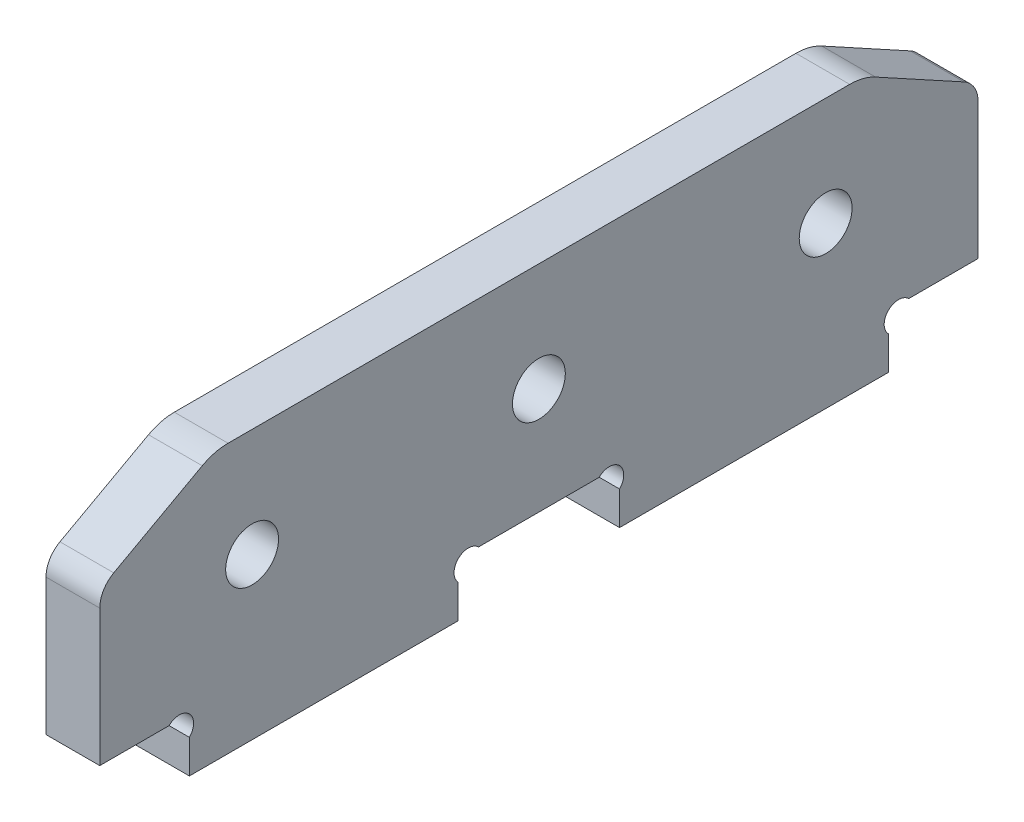
ISO-10303-21;
HEADER;
FILE_DESCRIPTION(('STEP AP214'),'2;1');
FILE_NAME('part.step','',(''),(''),'','','');
FILE_SCHEMA(('AUTOMOTIVE_DESIGN { 1 0 10303 214 1 1 1 1 }'));
ENDSEC;
DATA;
#1=APPLICATION_CONTEXT('core data for automotive mechanical design processes');
#2=APPLICATION_PROTOCOL_DEFINITION('international standard','automotive_design',2000,#1);
#3=PRODUCT_CONTEXT('',#1,'mechanical');
#4=PRODUCT('Part','Part','',(#3));
#5=PRODUCT_RELATED_PRODUCT_CATEGORY('part','',(#4));
#6=PRODUCT_DEFINITION_FORMATION('','',#4);
#7=PRODUCT_DEFINITION_CONTEXT('part definition',#1,'design');
#8=PRODUCT_DEFINITION('design','',#6,#7);
#9=PRODUCT_DEFINITION_SHAPE('','',#8);
#10=(LENGTH_UNIT() NAMED_UNIT(*) SI_UNIT(.MILLI.,.METRE.));
#11=(NAMED_UNIT(*) PLANE_ANGLE_UNIT() SI_UNIT($,.RADIAN.));
#12=(NAMED_UNIT(*) SI_UNIT($,.STERADIAN.) SOLID_ANGLE_UNIT());
#13=UNCERTAINTY_MEASURE_WITH_UNIT(LENGTH_MEASURE(1.E-05),#10,'distance_accuracy_value','');
#14=(GEOMETRIC_REPRESENTATION_CONTEXT(3) GLOBAL_UNCERTAINTY_ASSIGNED_CONTEXT((#13)) GLOBAL_UNIT_ASSIGNED_CONTEXT((#10,
#11,#12)) REPRESENTATION_CONTEXT('',''));
#15=CARTESIAN_POINT('',(0.,0.,0.));
#16=DIRECTION('',(0.,0.,1.));
#17=DIRECTION('',(1.,0.,0.));
#18=AXIS2_PLACEMENT_3D('',#15,#16,#17);
#19=CARTESIAN_POINT('',(6.,21.2224800303392,-3.));
#20=DIRECTION('',(-1.,0.,0.));
#21=DIRECTION('',(0.,0.,1.));
#22=AXIS2_PLACEMENT_3D('',#19,#20,#21);
#23=PLANE('',#22);
#24=CARTESIAN_POINT('',(6.,17.92,-17.));
#25=DIRECTION('',(1.,0.,0.));
#26=DIRECTION('',(0.,0.,-1.));
#27=AXIS2_PLACEMENT_3D('',#24,#25,#26);
#28=CIRCLE('',#27,2.95);
#29=CARTESIAN_POINT('',(6.,17.92,-19.95));
#30=VERTEX_POINT('',#29);
#31=EDGE_CURVE('E475',#30,#30,#28,.T.);
#32=ORIENTED_EDGE('',*,*,#31,.F.);
#33=EDGE_LOOP('',(#32));
#34=FACE_BOUND('',#33,.T.);
#35=CARTESIAN_POINT('',(6.,21.2224800303392,-3.));
#36=DIRECTION('',(1.,0.,0.));
#37=DIRECTION('',(0.,0.,1.));
#38=AXIS2_PLACEMENT_3D('',#35,#36,#37);
#39=CIRCLE('',#38,3.);
#40=CARTESIAN_POINT('',(6.,23.8537688338637,-1.55905613140326));
#41=VERTEX_POINT('',#40);
#42=CARTESIAN_POINT('',(6.,21.2224800303392,0.));
#43=VERTEX_POINT('',#42);
#44=EDGE_CURVE('E240',#41,#43,#39,.T.);
#45=ORIENTED_EDGE('',*,*,#44,.T.);
#46=DIRECTION('',(0.,-1.,0.));
#47=VECTOR('',#46,1.);
#48=CARTESIAN_POINT('',(6.,21.2224800303392,0.));
#49=LINE('',#48,#47);
#50=CARTESIAN_POINT('',(6.,6.,0.));
#51=VERTEX_POINT('',#50);
#52=EDGE_CURVE('E189',#43,#51,#49,.T.);
#53=ORIENTED_EDGE('',*,*,#52,.T.);
#54=DIRECTION('',(0.,0.,-1.));
#55=VECTOR('',#54,1.);
#56=CARTESIAN_POINT('',(6.,6.,0.));
#57=LINE('',#56,#55);
#58=CARTESIAN_POINT('',(6.,6.,-7.73725830020306));
#59=VERTEX_POINT('',#58);
#60=EDGE_CURVE('E243',#51,#59,#57,.T.);
#61=ORIENTED_EDGE('',*,*,#60,.T.);
#62=CARTESIAN_POINT('',(6.,4.86862915010151,-8.86862915010152));
#63=DIRECTION('',(-1.,0.,0.));
#64=DIRECTION('',(0.,0.,1.));
#65=AXIS2_PLACEMENT_3D('',#62,#63,#64);
#66=CIRCLE('',#65,1.6);
#67=CARTESIAN_POINT('',(6.,3.73725830020304,-10.));
#68=VERTEX_POINT('',#67);
#69=EDGE_CURVE('E245',#59,#68,#66,.T.);
#70=ORIENTED_EDGE('',*,*,#69,.T.);
#71=DIRECTION('',(0.,-1.,0.));
#72=VECTOR('',#71,1.);
#73=CARTESIAN_POINT('',(6.,3.73725830020304,-10.));
#74=LINE('',#73,#72);
#75=CARTESIAN_POINT('',(6.,0.,-10.));
#76=VERTEX_POINT('',#75);
#77=EDGE_CURVE('E247',#68,#76,#74,.T.);
#78=ORIENTED_EDGE('',*,*,#77,.T.);
#79=DIRECTION('',(0.,0.,-1.));
#80=VECTOR('',#79,1.);
#81=CARTESIAN_POINT('',(6.,0.,-10.));
#82=LINE('',#81,#80);
#83=CARTESIAN_POINT('',(6.,0.,-40.));
#84=VERTEX_POINT('',#83);
#85=EDGE_CURVE('E249',#76,#84,#82,.T.);
#86=ORIENTED_EDGE('',*,*,#85,.T.);
#87=DIRECTION('',(0.,1.,0.));
#88=VECTOR('',#87,1.);
#89=CARTESIAN_POINT('',(6.,0.,-40.));
#90=LINE('',#89,#88);
#91=CARTESIAN_POINT('',(6.,3.73725830020304,-40.));
#92=VERTEX_POINT('',#91);
#93=EDGE_CURVE('E251',#84,#92,#90,.T.);
#94=ORIENTED_EDGE('',*,*,#93,.T.);
#95=CARTESIAN_POINT('',(6.,4.86862915010152,-41.1313708498985));
#96=DIRECTION('',(-1.,0.,0.));
#97=DIRECTION('',(0.,0.,-1.));
#98=AXIS2_PLACEMENT_3D('',#95,#96,#97);
#99=CIRCLE('',#98,1.6);
#100=CARTESIAN_POINT('',(6.,6.,-42.2627416997969));
#101=VERTEX_POINT('',#100);
#102=EDGE_CURVE('E253',#92,#101,#99,.T.);
#103=ORIENTED_EDGE('',*,*,#102,.T.);
#104=DIRECTION('',(0.,0.,-1.));
#105=VECTOR('',#104,1.);
#106=CARTESIAN_POINT('',(6.,6.,-42.2627416997969));
#107=LINE('',#106,#105);
#108=CARTESIAN_POINT('',(6.,6.,-55.737258300203));
#109=VERTEX_POINT('',#108);
#110=EDGE_CURVE('E255',#101,#109,#107,.T.);
#111=ORIENTED_EDGE('',*,*,#110,.T.);
#112=CARTESIAN_POINT('',(6.,4.86862915010152,-56.8686291501015));
#113=DIRECTION('',(-1.,0.,0.));
#114=DIRECTION('',(0.,0.,1.));
#115=AXIS2_PLACEMENT_3D('',#112,#113,#114);
#116=CIRCLE('',#115,1.6);
#117=CARTESIAN_POINT('',(6.,3.73725830020305,-58.));
#118=VERTEX_POINT('',#117);
#119=EDGE_CURVE('E257',#109,#118,#116,.T.);
#120=ORIENTED_EDGE('',*,*,#119,.T.);
#121=DIRECTION('',(0.,-1.,0.));
#122=VECTOR('',#121,1.);
#123=CARTESIAN_POINT('',(6.,0.,-58.));
#124=LINE('',#123,#122);
#125=CARTESIAN_POINT('',(6.,0.,-58.));
#126=VERTEX_POINT('',#125);
#127=EDGE_CURVE('E259',#118,#126,#124,.T.);
#128=ORIENTED_EDGE('',*,*,#127,.T.);
#129=DIRECTION('',(0.,0.,-1.));
#130=VECTOR('',#129,1.);
#131=CARTESIAN_POINT('',(6.,0.,-88.));
#132=LINE('',#131,#130);
#133=CARTESIAN_POINT('',(6.,0.,-88.));
#134=VERTEX_POINT('',#133);
#135=EDGE_CURVE('E261',#126,#134,#132,.T.);
#136=ORIENTED_EDGE('',*,*,#135,.T.);
#137=DIRECTION('',(0.,1.,0.));
#138=VECTOR('',#137,1.);
#139=CARTESIAN_POINT('',(6.,3.73725830020307,-88.));
#140=LINE('',#139,#138);
#141=CARTESIAN_POINT('',(6.,3.73725830020307,-88.));
#142=VERTEX_POINT('',#141);
#143=EDGE_CURVE('E263',#134,#142,#140,.T.);
#144=ORIENTED_EDGE('',*,*,#143,.T.);
#145=CARTESIAN_POINT('',(6.,4.86862915010154,-89.1313708498984));
#146=DIRECTION('',(-1.,0.,0.));
#147=DIRECTION('',(0.,0.,-1.));
#148=AXIS2_PLACEMENT_3D('',#145,#146,#147);
#149=CIRCLE('',#148,1.6);
#150=CARTESIAN_POINT('',(6.,6.00000000000003,-90.2627416997969));
#151=VERTEX_POINT('',#150);
#152=EDGE_CURVE('E265',#142,#151,#149,.T.);
#153=ORIENTED_EDGE('',*,*,#152,.T.);
#154=DIRECTION('',(0.,0.,-1.));
#155=VECTOR('',#154,1.);
#156=CARTESIAN_POINT('',(6.,6.00000000000003,-98.));
#157=LINE('',#156,#155);
#158=CARTESIAN_POINT('',(6.,6.00000000000003,-98.));
#159=VERTEX_POINT('',#158);
#160=EDGE_CURVE('E267',#151,#159,#157,.T.);
#161=ORIENTED_EDGE('',*,*,#160,.T.);
#162=DIRECTION('',(0.,1.,0.));
#163=VECTOR('',#162,1.);
#164=CARTESIAN_POINT('',(6.,21.2224800303392,-98.));
#165=LINE('',#164,#163);
#166=CARTESIAN_POINT('',(6.,21.2224800303392,-98.));
#167=VERTEX_POINT('',#166);
#168=EDGE_CURVE('E269',#159,#167,#165,.T.);
#169=ORIENTED_EDGE('',*,*,#168,.T.);
#170=CARTESIAN_POINT('',(6.,21.2224800303392,-95.));
#171=DIRECTION('',(1.,0.,0.));
#172=DIRECTION('',(0.,0.,1.));
#173=AXIS2_PLACEMENT_3D('',#170,#171,#172);
#174=CIRCLE('',#173,3.);
#175=CARTESIAN_POINT('',(6.,23.8537688338637,-96.4409438685967));
#176=VERTEX_POINT('',#175);
#177=EDGE_CURVE('E271',#167,#176,#174,.T.);
#178=ORIENTED_EDGE('',*,*,#177,.T.);
#179=DIRECTION('',(0.,0.480314622865584,0.877096267841502));
#180=VECTOR('',#179,1.);
#181=CARTESIAN_POINT('',(6.,23.8537688338637,-96.4409438685967));
#182=LINE('',#181,#180);
#183=CARTESIAN_POINT('',(6.,29.262577607049,-86.5639887175627));
#184=VERTEX_POINT('',#183);
#185=EDGE_CURVE('E273',#176,#184,#182,.T.);
#186=ORIENTED_EDGE('',*,*,#185,.T.);
#187=CARTESIAN_POINT('',(6.,24.,-83.6821009803692));
#188=DIRECTION('',(1.,0.,0.));
#189=DIRECTION('',(0.,0.,1.));
#190=AXIS2_PLACEMENT_3D('',#187,#188,#189);
#191=CIRCLE('',#190,6.);
#192=CARTESIAN_POINT('',(6.,30.,-83.6821009803692));
#193=VERTEX_POINT('',#192);
#194=EDGE_CURVE('E275',#184,#193,#191,.T.);
#195=ORIENTED_EDGE('',*,*,#194,.T.);
#196=DIRECTION('',(0.,0.,1.));
#197=VECTOR('',#196,1.);
#198=CARTESIAN_POINT('',(6.,30.,-14.3178990196308));
#199=LINE('',#198,#197);
#200=CARTESIAN_POINT('',(6.,30.,-14.3178990196308));
#201=VERTEX_POINT('',#200);
#202=EDGE_CURVE('E277',#193,#201,#199,.T.);
#203=ORIENTED_EDGE('',*,*,#202,.T.);
#204=CARTESIAN_POINT('',(6.,24.,-14.3178990196308));
#205=DIRECTION('',(1.,0.,0.));
#206=DIRECTION('',(0.,0.,1.));
#207=AXIS2_PLACEMENT_3D('',#204,#205,#206);
#208=CIRCLE('',#207,6.);
#209=CARTESIAN_POINT('',(6.,29.262577607049,-11.4360112824373));
#210=VERTEX_POINT('',#209);
#211=EDGE_CURVE('E46',#201,#210,#208,.T.);
#212=ORIENTED_EDGE('',*,*,#211,.T.);
#213=DIRECTION('',(0.,-0.480314622865584,0.877096267841502));
#214=VECTOR('',#213,1.);
#215=CARTESIAN_POINT('',(6.,23.8537688338637,-1.55905613140326));
#216=LINE('',#215,#214);
#217=EDGE_CURVE('E41',#210,#41,#216,.T.);
#218=ORIENTED_EDGE('',*,*,#217,.T.);
#219=EDGE_LOOP('',(#45,#53,#61,#70,#78,#86,#94,#103,#111,#120,#128,#136,#144,#153,#161,#169,
#178,#186,#195,#203,#212,#218));
#220=FACE_BOUND('',#219,.T.);
#221=CARTESIAN_POINT('',(6.,17.92,-49.));
#222=DIRECTION('',(1.,0.,0.));
#223=DIRECTION('',(0.,0.,-1.));
#224=AXIS2_PLACEMENT_3D('',#221,#222,#223);
#225=CIRCLE('',#224,2.95);
#226=CARTESIAN_POINT('',(6.,17.92,-51.95));
#227=VERTEX_POINT('',#226);
#228=EDGE_CURVE('E194',#227,#227,#225,.T.);
#229=ORIENTED_EDGE('',*,*,#228,.F.);
#230=EDGE_LOOP('',(#229));
#231=FACE_BOUND('',#230,.T.);
#232=CARTESIAN_POINT('',(6.,17.92,-81.));
#233=DIRECTION('',(1.,0.,0.));
#234=DIRECTION('',(0.,0.,1.));
#235=AXIS2_PLACEMENT_3D('',#232,#233,#234);
#236=CIRCLE('',#235,2.95);
#237=CARTESIAN_POINT('',(6.,17.92,-78.05));
#238=VERTEX_POINT('',#237);
#239=EDGE_CURVE('E464',#238,#238,#236,.T.);
#240=ORIENTED_EDGE('',*,*,#239,.F.);
#241=EDGE_LOOP('',(#240));
#242=FACE_BOUND('',#241,.T.);
#243=ADVANCED_FACE('F26',(#34,#220,#231,#242),#23,.F.);
#244=CARTESIAN_POINT('',(0.,21.2224800303392,-3.));
#245=DIRECTION('',(-1.,0.,0.));
#246=DIRECTION('',(0.,0.,1.));
#247=AXIS2_PLACEMENT_3D('',#244,#245,#246);
#248=PLANE('',#247);
#249=CARTESIAN_POINT('',(0.,17.92,-17.));
#250=DIRECTION('',(1.,0.,0.));
#251=DIRECTION('',(0.,0.,-1.));
#252=AXIS2_PLACEMENT_3D('',#249,#250,#251);
#253=CIRCLE('',#252,2.95);
#254=CARTESIAN_POINT('',(0.,17.92,-19.95));
#255=VERTEX_POINT('',#254);
#256=EDGE_CURVE('E470',#255,#255,#253,.T.);
#257=ORIENTED_EDGE('',*,*,#256,.T.);
#258=EDGE_LOOP('',(#257));
#259=FACE_BOUND('',#258,.T.);
#260=CARTESIAN_POINT('',(0.,21.2224800303392,-3.));
#261=DIRECTION('',(1.,0.,0.));
#262=DIRECTION('',(0.,0.,1.));
#263=AXIS2_PLACEMENT_3D('',#260,#261,#262);
#264=CIRCLE('',#263,3.);
#265=CARTESIAN_POINT('',(0.,23.8537688338637,-1.55905613140326));
#266=VERTEX_POINT('',#265);
#267=CARTESIAN_POINT('',(0.,21.2224800303392,0.));
#268=VERTEX_POINT('',#267);
#269=EDGE_CURVE('E180',#266,#268,#264,.T.);
#270=ORIENTED_EDGE('',*,*,#269,.F.);
#271=DIRECTION('',(0.,-0.480314622865584,0.877096267841502));
#272=VECTOR('',#271,1.);
#273=CARTESIAN_POINT('',(0.,23.8537688338637,-1.55905613140326));
#274=LINE('',#273,#272);
#275=CARTESIAN_POINT('',(0.,29.262577607049,-11.4360112824373));
#276=VERTEX_POINT('',#275);
#277=EDGE_CURVE('E238',#276,#266,#274,.T.);
#278=ORIENTED_EDGE('',*,*,#277,.F.);
#279=CARTESIAN_POINT('',(0.,24.,-14.3178990196308));
#280=DIRECTION('',(1.,0.,0.));
#281=DIRECTION('',(0.,0.,1.));
#282=AXIS2_PLACEMENT_3D('',#279,#280,#281);
#283=CIRCLE('',#282,6.);
#284=CARTESIAN_POINT('',(0.,30.,-14.3178990196308));
#285=VERTEX_POINT('',#284);
#286=EDGE_CURVE('E236',#285,#276,#283,.T.);
#287=ORIENTED_EDGE('',*,*,#286,.F.);
#288=DIRECTION('',(0.,0.,1.));
#289=VECTOR('',#288,1.);
#290=CARTESIAN_POINT('',(0.,30.,-14.3178990196308));
#291=LINE('',#290,#289);
#292=CARTESIAN_POINT('',(0.,30.,-83.6821009803692));
#293=VERTEX_POINT('',#292);
#294=EDGE_CURVE('E234',#293,#285,#291,.T.);
#295=ORIENTED_EDGE('',*,*,#294,.F.);
#296=CARTESIAN_POINT('',(0.,24.,-83.6821009803692));
#297=DIRECTION('',(1.,0.,0.));
#298=DIRECTION('',(0.,0.,1.));
#299=AXIS2_PLACEMENT_3D('',#296,#297,#298);
#300=CIRCLE('',#299,6.);
#301=CARTESIAN_POINT('',(0.,29.262577607049,-86.5639887175627));
#302=VERTEX_POINT('',#301);
#303=EDGE_CURVE('E232',#302,#293,#300,.T.);
#304=ORIENTED_EDGE('',*,*,#303,.F.);
#305=DIRECTION('',(0.,0.480314622865584,0.877096267841502));
#306=VECTOR('',#305,1.);
#307=CARTESIAN_POINT('',(0.,23.8537688338637,-96.4409438685967));
#308=LINE('',#307,#306);
#309=CARTESIAN_POINT('',(0.,23.8537688338637,-96.4409438685967));
#310=VERTEX_POINT('',#309);
#311=EDGE_CURVE('E230',#310,#302,#308,.T.);
#312=ORIENTED_EDGE('',*,*,#311,.F.);
#313=CARTESIAN_POINT('',(0.,21.2224800303392,-95.));
#314=DIRECTION('',(1.,0.,0.));
#315=DIRECTION('',(0.,0.,1.));
#316=AXIS2_PLACEMENT_3D('',#313,#314,#315);
#317=CIRCLE('',#316,3.);
#318=CARTESIAN_POINT('',(0.,21.2224800303392,-98.));
#319=VERTEX_POINT('',#318);
#320=EDGE_CURVE('E228',#319,#310,#317,.T.);
#321=ORIENTED_EDGE('',*,*,#320,.F.);
#322=DIRECTION('',(0.,1.,0.));
#323=VECTOR('',#322,1.);
#324=CARTESIAN_POINT('',(0.,21.2224800303392,-98.));
#325=LINE('',#324,#323);
#326=CARTESIAN_POINT('',(0.,6.00000000000003,-98.));
#327=VERTEX_POINT('',#326);
#328=EDGE_CURVE('E226',#327,#319,#325,.T.);
#329=ORIENTED_EDGE('',*,*,#328,.F.);
#330=DIRECTION('',(0.,0.,-1.));
#331=VECTOR('',#330,1.);
#332=CARTESIAN_POINT('',(0.,6.00000000000003,-98.));
#333=LINE('',#332,#331);
#334=CARTESIAN_POINT('',(0.,6.00000000000003,-90.2627416997969));
#335=VERTEX_POINT('',#334);
#336=EDGE_CURVE('E224',#335,#327,#333,.T.);
#337=ORIENTED_EDGE('',*,*,#336,.F.);
#338=CARTESIAN_POINT('',(0.,4.86862915010154,-89.1313708498984));
#339=DIRECTION('',(-1.,0.,0.));
#340=DIRECTION('',(0.,0.,-1.));
#341=AXIS2_PLACEMENT_3D('',#338,#339,#340);
#342=CIRCLE('',#341,1.6);
#343=CARTESIAN_POINT('',(0.,3.73725830020307,-88.));
#344=VERTEX_POINT('',#343);
#345=EDGE_CURVE('E222',#344,#335,#342,.T.);
#346=ORIENTED_EDGE('',*,*,#345,.F.);
#347=DIRECTION('',(0.,1.,0.));
#348=VECTOR('',#347,1.);
#349=CARTESIAN_POINT('',(0.,3.73725830020307,-88.));
#350=LINE('',#349,#348);
#351=CARTESIAN_POINT('',(0.,0.,-88.));
#352=VERTEX_POINT('',#351);
#353=EDGE_CURVE('E220',#352,#344,#350,.T.);
#354=ORIENTED_EDGE('',*,*,#353,.F.);
#355=DIRECTION('',(0.,0.,-1.));
#356=VECTOR('',#355,1.);
#357=CARTESIAN_POINT('',(0.,0.,-88.));
#358=LINE('',#357,#356);
#359=CARTESIAN_POINT('',(0.,0.,-58.));
#360=VERTEX_POINT('',#359);
#361=EDGE_CURVE('E218',#360,#352,#358,.T.);
#362=ORIENTED_EDGE('',*,*,#361,.F.);
#363=DIRECTION('',(0.,-1.,0.));
#364=VECTOR('',#363,1.);
#365=CARTESIAN_POINT('',(0.,0.,-58.));
#366=LINE('',#365,#364);
#367=CARTESIAN_POINT('',(0.,3.73725830020305,-58.));
#368=VERTEX_POINT('',#367);
#369=EDGE_CURVE('E216',#368,#360,#366,.T.);
#370=ORIENTED_EDGE('',*,*,#369,.F.);
#371=CARTESIAN_POINT('',(0.,4.86862915010152,-56.8686291501015));
#372=DIRECTION('',(-1.,0.,0.));
#373=DIRECTION('',(0.,0.,1.));
#374=AXIS2_PLACEMENT_3D('',#371,#372,#373);
#375=CIRCLE('',#374,1.6);
#376=CARTESIAN_POINT('',(0.,6.,-55.737258300203));
#377=VERTEX_POINT('',#376);
#378=EDGE_CURVE('E214',#377,#368,#375,.T.);
#379=ORIENTED_EDGE('',*,*,#378,.F.);
#380=DIRECTION('',(0.,0.,-1.));
#381=VECTOR('',#380,1.);
#382=CARTESIAN_POINT('',(0.,6.,-42.2627416997969));
#383=LINE('',#382,#381);
#384=CARTESIAN_POINT('',(0.,6.,-42.2627416997969));
#385=VERTEX_POINT('',#384);
#386=EDGE_CURVE('E212',#385,#377,#383,.T.);
#387=ORIENTED_EDGE('',*,*,#386,.F.);
#388=CARTESIAN_POINT('',(0.,4.86862915010152,-41.1313708498985));
#389=DIRECTION('',(-1.,0.,0.));
#390=DIRECTION('',(0.,0.,-1.));
#391=AXIS2_PLACEMENT_3D('',#388,#389,#390);
#392=CIRCLE('',#391,1.6);
#393=CARTESIAN_POINT('',(0.,3.73725830020304,-40.));
#394=VERTEX_POINT('',#393);
#395=EDGE_CURVE('E210',#394,#385,#392,.T.);
#396=ORIENTED_EDGE('',*,*,#395,.F.);
#397=DIRECTION('',(0.,1.,0.));
#398=VECTOR('',#397,1.);
#399=CARTESIAN_POINT('',(0.,0.,-40.));
#400=LINE('',#399,#398);
#401=CARTESIAN_POINT('',(0.,0.,-40.));
#402=VERTEX_POINT('',#401);
#403=EDGE_CURVE('E208',#402,#394,#400,.T.);
#404=ORIENTED_EDGE('',*,*,#403,.F.);
#405=DIRECTION('',(0.,0.,-1.));
#406=VECTOR('',#405,1.);
#407=CARTESIAN_POINT('',(0.,0.,-10.));
#408=LINE('',#407,#406);
#409=CARTESIAN_POINT('',(0.,0.,-10.));
#410=VERTEX_POINT('',#409);
#411=EDGE_CURVE('E206',#410,#402,#408,.T.);
#412=ORIENTED_EDGE('',*,*,#411,.F.);
#413=DIRECTION('',(0.,-1.,0.));
#414=VECTOR('',#413,1.);
#415=CARTESIAN_POINT('',(0.,3.73725830020304,-10.));
#416=LINE('',#415,#414);
#417=CARTESIAN_POINT('',(0.,3.73725830020304,-10.));
#418=VERTEX_POINT('',#417);
#419=EDGE_CURVE('E204',#418,#410,#416,.T.);
#420=ORIENTED_EDGE('',*,*,#419,.F.);
#421=CARTESIAN_POINT('',(0.,4.86862915010151,-8.86862915010152));
#422=DIRECTION('',(-1.,0.,0.));
#423=DIRECTION('',(0.,0.,1.));
#424=AXIS2_PLACEMENT_3D('',#421,#422,#423);
#425=CIRCLE('',#424,1.6);
#426=CARTESIAN_POINT('',(0.,6.,-7.73725830020306));
#427=VERTEX_POINT('',#426);
#428=EDGE_CURVE('E202',#427,#418,#425,.T.);
#429=ORIENTED_EDGE('',*,*,#428,.F.);
#430=DIRECTION('',(0.,0.,-1.));
#431=VECTOR('',#430,1.);
#432=CARTESIAN_POINT('',(0.,6.,0.));
#433=LINE('',#432,#431);
#434=CARTESIAN_POINT('',(0.,6.,0.));
#435=VERTEX_POINT('',#434);
#436=EDGE_CURVE('E182',#435,#427,#433,.T.);
#437=ORIENTED_EDGE('',*,*,#436,.F.);
#438=DIRECTION('',(0.,-1.,0.));
#439=VECTOR('',#438,1.);
#440=CARTESIAN_POINT('',(0.,21.2224800303392,0.));
#441=LINE('',#440,#439);
#442=EDGE_CURVE('E175',#268,#435,#441,.T.);
#443=ORIENTED_EDGE('',*,*,#442,.F.);
#444=EDGE_LOOP('',(#270,#278,#287,#295,#304,#312,#321,#329,#337,#346,#354,#362,#370,#379,#387,
#396,#404,#412,#420,#429,#437,#443));
#445=FACE_BOUND('',#444,.T.);
#446=CARTESIAN_POINT('',(0.,17.92,-49.));
#447=DIRECTION('',(1.,0.,0.));
#448=DIRECTION('',(0.,0.,-1.));
#449=AXIS2_PLACEMENT_3D('',#446,#447,#448);
#450=CIRCLE('',#449,2.95);
#451=CARTESIAN_POINT('',(0.,17.92,-51.95));
#452=VERTEX_POINT('',#451);
#453=EDGE_CURVE('E197',#452,#452,#450,.T.);
#454=ORIENTED_EDGE('',*,*,#453,.T.);
#455=EDGE_LOOP('',(#454));
#456=FACE_BOUND('',#455,.T.);
#457=CARTESIAN_POINT('',(0.,17.92,-81.));
#458=DIRECTION('',(1.,0.,0.));
#459=DIRECTION('',(0.,0.,1.));
#460=AXIS2_PLACEMENT_3D('',#457,#458,#459);
#461=CIRCLE('',#460,2.95);
#462=CARTESIAN_POINT('',(0.,17.92,-78.05));
#463=VERTEX_POINT('',#462);
#464=EDGE_CURVE('E467',#463,#463,#461,.T.);
#465=ORIENTED_EDGE('',*,*,#464,.T.);
#466=EDGE_LOOP('',(#465));
#467=FACE_BOUND('',#466,.T.);
#468=ADVANCED_FACE('F176',(#259,#445,#456,#467),#248,.T.);
#469=CARTESIAN_POINT('',(6.,21.2224800303392,-3.));
#470=DIRECTION('',(-1.,0.,0.));
#471=DIRECTION('',(0.,0.,1.));
#472=AXIS2_PLACEMENT_3D('',#469,#470,#471);
#473=CYLINDRICAL_SURFACE('',#472,3.);
#474=ORIENTED_EDGE('',*,*,#269,.T.);
#475=DIRECTION('',(-1.,0.,0.));
#476=VECTOR('',#475,1.);
#477=CARTESIAN_POINT('',(6.,21.2224800303392,0.));
#478=LINE('',#477,#476);
#479=EDGE_CURVE('E11',#43,#268,#478,.T.);
#480=ORIENTED_EDGE('',*,*,#479,.F.);
#481=ORIENTED_EDGE('',*,*,#44,.F.);
#482=DIRECTION('',(-1.,0.,0.));
#483=VECTOR('',#482,1.);
#484=CARTESIAN_POINT('',(6.,23.8537688338637,-1.55905613140326));
#485=LINE('',#484,#483);
#486=EDGE_CURVE('E193',#41,#266,#485,.T.);
#487=ORIENTED_EDGE('',*,*,#486,.T.);
#488=EDGE_LOOP('',(#474,#480,#481,#487));
#489=FACE_BOUND('',#488,.T.);
#490=ADVANCED_FACE('F28',(#489),#473,.T.);
#491=CARTESIAN_POINT('',(6.,21.2224800303392,0.));
#492=DIRECTION('',(0.,0.,-1.));
#493=DIRECTION('',(-1.,0.,0.));
#494=AXIS2_PLACEMENT_3D('',#491,#492,#493);
#495=PLANE('',#494);
#496=ORIENTED_EDGE('',*,*,#442,.T.);
#497=DIRECTION('',(-1.,0.,0.));
#498=VECTOR('',#497,1.);
#499=CARTESIAN_POINT('',(6.,6.,0.));
#500=LINE('',#499,#498);
#501=EDGE_CURVE('E34',#51,#435,#500,.T.);
#502=ORIENTED_EDGE('',*,*,#501,.F.);
#503=ORIENTED_EDGE('',*,*,#52,.F.);
#504=ORIENTED_EDGE('',*,*,#479,.T.);
#505=EDGE_LOOP('',(#496,#502,#503,#504));
#506=FACE_BOUND('',#505,.T.);
#507=ADVANCED_FACE('F188',(#506),#495,.F.);
#508=CARTESIAN_POINT('',(6.,6.,0.));
#509=DIRECTION('',(0.,1.,0.));
#510=DIRECTION('',(0.,0.,1.));
#511=AXIS2_PLACEMENT_3D('',#508,#509,#510);
#512=PLANE('',#511);
#513=ORIENTED_EDGE('',*,*,#436,.T.);
#514=DIRECTION('',(-1.,0.,0.));
#515=VECTOR('',#514,1.);
#516=CARTESIAN_POINT('',(6.,6.,-7.73725830020306));
#517=LINE('',#516,#515);
#518=EDGE_CURVE('E336',#59,#427,#517,.T.);
#519=ORIENTED_EDGE('',*,*,#518,.F.);
#520=ORIENTED_EDGE('',*,*,#60,.F.);
#521=ORIENTED_EDGE('',*,*,#501,.T.);
#522=EDGE_LOOP('',(#513,#519,#520,#521));
#523=FACE_BOUND('',#522,.T.);
#524=ADVANCED_FACE('F340',(#523),#512,.F.);
#525=CARTESIAN_POINT('',(6.,4.86862915010151,-8.86862915010152));
#526=DIRECTION('',(-1.,0.,0.));
#527=DIRECTION('',(0.,0.,1.));
#528=AXIS2_PLACEMENT_3D('',#525,#526,#527);
#529=CYLINDRICAL_SURFACE('',#528,1.6);
#530=ORIENTED_EDGE('',*,*,#428,.T.);
#531=DIRECTION('',(-1.,0.,0.));
#532=VECTOR('',#531,1.);
#533=CARTESIAN_POINT('',(6.,3.73725830020304,-10.));
#534=LINE('',#533,#532);
#535=EDGE_CURVE('E333',#68,#418,#534,.T.);
#536=ORIENTED_EDGE('',*,*,#535,.F.);
#537=ORIENTED_EDGE('',*,*,#69,.F.);
#538=ORIENTED_EDGE('',*,*,#518,.T.);
#539=EDGE_LOOP('',(#530,#536,#537,#538));
#540=FACE_BOUND('',#539,.T.);
#541=ADVANCED_FACE('F348',(#540),#529,.F.);
#542=CARTESIAN_POINT('',(6.,3.73725830020304,-10.));
#543=DIRECTION('',(0.,0.,-1.));
#544=DIRECTION('',(-1.,0.,0.));
#545=AXIS2_PLACEMENT_3D('',#542,#543,#544);
#546=PLANE('',#545);
#547=ORIENTED_EDGE('',*,*,#419,.T.);
#548=DIRECTION('',(-1.,0.,0.));
#549=VECTOR('',#548,1.);
#550=CARTESIAN_POINT('',(6.,0.,-10.));
#551=LINE('',#550,#549);
#552=EDGE_CURVE('E330',#76,#410,#551,.T.);
#553=ORIENTED_EDGE('',*,*,#552,.F.);
#554=ORIENTED_EDGE('',*,*,#77,.F.);
#555=ORIENTED_EDGE('',*,*,#535,.T.);
#556=EDGE_LOOP('',(#547,#553,#554,#555));
#557=FACE_BOUND('',#556,.T.);
#558=ADVANCED_FACE('F351',(#557),#546,.F.);
#559=CARTESIAN_POINT('',(6.,0.,-10.));
#560=DIRECTION('',(0.,1.,0.));
#561=DIRECTION('',(0.,0.,1.));
#562=AXIS2_PLACEMENT_3D('',#559,#560,#561);
#563=PLANE('',#562);
#564=ORIENTED_EDGE('',*,*,#411,.T.);
#565=DIRECTION('',(-1.,0.,0.));
#566=VECTOR('',#565,1.);
#567=CARTESIAN_POINT('',(6.,0.,-40.));
#568=LINE('',#567,#566);
#569=EDGE_CURVE('E327',#84,#402,#568,.T.);
#570=ORIENTED_EDGE('',*,*,#569,.F.);
#571=ORIENTED_EDGE('',*,*,#85,.F.);
#572=ORIENTED_EDGE('',*,*,#552,.T.);
#573=EDGE_LOOP('',(#564,#570,#571,#572));
#574=FACE_BOUND('',#573,.T.);
#575=ADVANCED_FACE('F356',(#574),#563,.F.);
#576=CARTESIAN_POINT('',(6.,0.,-40.));
#577=DIRECTION('',(0.,0.,1.));
#578=DIRECTION('',(0.,-1.,0.));
#579=AXIS2_PLACEMENT_3D('',#576,#577,#578);
#580=PLANE('',#579);
#581=ORIENTED_EDGE('',*,*,#403,.T.);
#582=DIRECTION('',(-1.,0.,0.));
#583=VECTOR('',#582,1.);
#584=CARTESIAN_POINT('',(6.,3.73725830020304,-40.));
#585=LINE('',#584,#583);
#586=EDGE_CURVE('E324',#92,#394,#585,.T.);
#587=ORIENTED_EDGE('',*,*,#586,.F.);
#588=ORIENTED_EDGE('',*,*,#93,.F.);
#589=ORIENTED_EDGE('',*,*,#569,.T.);
#590=EDGE_LOOP('',(#581,#587,#588,#589));
#591=FACE_BOUND('',#590,.T.);
#592=ADVANCED_FACE('F362',(#591),#580,.F.);
#593=CARTESIAN_POINT('',(6.,4.86862915010152,-41.1313708498985));
#594=DIRECTION('',(-1.,0.,0.));
#595=DIRECTION('',(0.,0.,1.));
#596=AXIS2_PLACEMENT_3D('',#593,#594,#595);
#597=CYLINDRICAL_SURFACE('',#596,1.6);
#598=ORIENTED_EDGE('',*,*,#395,.T.);
#599=DIRECTION('',(-1.,0.,0.));
#600=VECTOR('',#599,1.);
#601=CARTESIAN_POINT('',(6.,6.,-42.2627416997969));
#602=LINE('',#601,#600);
#603=EDGE_CURVE('E321',#101,#385,#602,.T.);
#604=ORIENTED_EDGE('',*,*,#603,.F.);
#605=ORIENTED_EDGE('',*,*,#102,.F.);
#606=ORIENTED_EDGE('',*,*,#586,.T.);
#607=EDGE_LOOP('',(#598,#604,#605,#606));
#608=FACE_BOUND('',#607,.T.);
#609=ADVANCED_FACE('F366',(#608),#597,.F.);
#610=CARTESIAN_POINT('',(6.,6.,-42.2627416997969));
#611=DIRECTION('',(0.,1.,0.));
#612=DIRECTION('',(0.,0.,1.));
#613=AXIS2_PLACEMENT_3D('',#610,#611,#612);
#614=PLANE('',#613);
#615=ORIENTED_EDGE('',*,*,#386,.T.);
#616=DIRECTION('',(-1.,0.,0.));
#617=VECTOR('',#616,1.);
#618=CARTESIAN_POINT('',(6.,6.,-55.737258300203));
#619=LINE('',#618,#617);
#620=EDGE_CURVE('E318',#109,#377,#619,.T.);
#621=ORIENTED_EDGE('',*,*,#620,.F.);
#622=ORIENTED_EDGE('',*,*,#110,.F.);
#623=ORIENTED_EDGE('',*,*,#603,.T.);
#624=EDGE_LOOP('',(#615,#621,#622,#623));
#625=FACE_BOUND('',#624,.T.);
#626=ADVANCED_FACE('F371',(#625),#614,.F.);
#627=CARTESIAN_POINT('',(6.,4.86862915010152,-56.8686291501015));
#628=DIRECTION('',(-1.,0.,0.));
#629=DIRECTION('',(0.,0.,1.));
#630=AXIS2_PLACEMENT_3D('',#627,#628,#629);
#631=CYLINDRICAL_SURFACE('',#630,1.6);
#632=ORIENTED_EDGE('',*,*,#378,.T.);
#633=DIRECTION('',(-1.,0.,0.));
#634=VECTOR('',#633,1.);
#635=CARTESIAN_POINT('',(6.,3.73725830020305,-58.));
#636=LINE('',#635,#634);
#637=EDGE_CURVE('E315',#118,#368,#636,.T.);
#638=ORIENTED_EDGE('',*,*,#637,.F.);
#639=ORIENTED_EDGE('',*,*,#119,.F.);
#640=ORIENTED_EDGE('',*,*,#620,.T.);
#641=EDGE_LOOP('',(#632,#638,#639,#640));
#642=FACE_BOUND('',#641,.T.);
#643=ADVANCED_FACE('F377',(#642),#631,.F.);
#644=CARTESIAN_POINT('',(6.,0.,-58.));
#645=DIRECTION('',(0.,0.,-1.));
#646=DIRECTION('',(0.,1.,0.));
#647=AXIS2_PLACEMENT_3D('',#644,#645,#646);
#648=PLANE('',#647);
#649=ORIENTED_EDGE('',*,*,#369,.T.);
#650=DIRECTION('',(-1.,0.,0.));
#651=VECTOR('',#650,1.);
#652=CARTESIAN_POINT('',(6.,0.,-58.));
#653=LINE('',#652,#651);
#654=EDGE_CURVE('E312',#126,#360,#653,.T.);
#655=ORIENTED_EDGE('',*,*,#654,.F.);
#656=ORIENTED_EDGE('',*,*,#127,.F.);
#657=ORIENTED_EDGE('',*,*,#637,.T.);
#658=EDGE_LOOP('',(#649,#655,#656,#657));
#659=FACE_BOUND('',#658,.T.);
#660=ADVANCED_FACE('F381',(#659),#648,.F.);
#661=CARTESIAN_POINT('',(6.,0.,-88.));
#662=DIRECTION('',(0.,1.,0.));
#663=DIRECTION('',(0.,0.,1.));
#664=AXIS2_PLACEMENT_3D('',#661,#662,#663);
#665=PLANE('',#664);
#666=ORIENTED_EDGE('',*,*,#361,.T.);
#667=DIRECTION('',(-1.,0.,0.));
#668=VECTOR('',#667,1.);
#669=CARTESIAN_POINT('',(6.,0.,-88.));
#670=LINE('',#669,#668);
#671=EDGE_CURVE('E309',#134,#352,#670,.T.);
#672=ORIENTED_EDGE('',*,*,#671,.F.);
#673=ORIENTED_EDGE('',*,*,#135,.F.);
#674=ORIENTED_EDGE('',*,*,#654,.T.);
#675=EDGE_LOOP('',(#666,#672,#673,#674));
#676=FACE_BOUND('',#675,.T.);
#677=ADVANCED_FACE('F386',(#676),#665,.F.);
#678=CARTESIAN_POINT('',(6.,3.73725830020307,-88.));
#679=DIRECTION('',(0.,0.,1.));
#680=DIRECTION('',(0.,-1.,0.));
#681=AXIS2_PLACEMENT_3D('',#678,#679,#680);
#682=PLANE('',#681);
#683=ORIENTED_EDGE('',*,*,#353,.T.);
#684=DIRECTION('',(-1.,0.,0.));
#685=VECTOR('',#684,1.);
#686=CARTESIAN_POINT('',(6.,3.73725830020307,-88.));
#687=LINE('',#686,#685);
#688=EDGE_CURVE('E306',#142,#344,#687,.T.);
#689=ORIENTED_EDGE('',*,*,#688,.F.);
#690=ORIENTED_EDGE('',*,*,#143,.F.);
#691=ORIENTED_EDGE('',*,*,#671,.T.);
#692=EDGE_LOOP('',(#683,#689,#690,#691));
#693=FACE_BOUND('',#692,.T.);
#694=ADVANCED_FACE('F392',(#693),#682,.F.);
#695=CARTESIAN_POINT('',(6.,4.86862915010154,-89.1313708498984));
#696=DIRECTION('',(-1.,0.,0.));
#697=DIRECTION('',(0.,0.,1.));
#698=AXIS2_PLACEMENT_3D('',#695,#696,#697);
#699=CYLINDRICAL_SURFACE('',#698,1.6);
#700=ORIENTED_EDGE('',*,*,#345,.T.);
#701=DIRECTION('',(-1.,0.,0.));
#702=VECTOR('',#701,1.);
#703=CARTESIAN_POINT('',(6.,6.00000000000003,-90.2627416997969));
#704=LINE('',#703,#702);
#705=EDGE_CURVE('E303',#151,#335,#704,.T.);
#706=ORIENTED_EDGE('',*,*,#705,.F.);
#707=ORIENTED_EDGE('',*,*,#152,.F.);
#708=ORIENTED_EDGE('',*,*,#688,.T.);
#709=EDGE_LOOP('',(#700,#706,#707,#708));
#710=FACE_BOUND('',#709,.T.);
#711=ADVANCED_FACE('F396',(#710),#699,.F.);
#712=CARTESIAN_POINT('',(6.,6.00000000000003,-98.));
#713=DIRECTION('',(0.,1.,0.));
#714=DIRECTION('',(0.,0.,1.));
#715=AXIS2_PLACEMENT_3D('',#712,#713,#714);
#716=PLANE('',#715);
#717=ORIENTED_EDGE('',*,*,#336,.T.);
#718=DIRECTION('',(-1.,0.,0.));
#719=VECTOR('',#718,1.);
#720=CARTESIAN_POINT('',(6.,6.00000000000003,-98.));
#721=LINE('',#720,#719);
#722=EDGE_CURVE('E300',#159,#327,#721,.T.);
#723=ORIENTED_EDGE('',*,*,#722,.F.);
#724=ORIENTED_EDGE('',*,*,#160,.F.);
#725=ORIENTED_EDGE('',*,*,#705,.T.);
#726=EDGE_LOOP('',(#717,#723,#724,#725));
#727=FACE_BOUND('',#726,.T.);
#728=ADVANCED_FACE('F401',(#727),#716,.F.);
#729=CARTESIAN_POINT('',(6.,21.2224800303392,-98.));
#730=DIRECTION('',(0.,0.,1.));
#731=DIRECTION('',(1.,0.,0.));
#732=AXIS2_PLACEMENT_3D('',#729,#730,#731);
#733=PLANE('',#732);
#734=ORIENTED_EDGE('',*,*,#328,.T.);
#735=DIRECTION('',(-1.,0.,0.));
#736=VECTOR('',#735,1.);
#737=CARTESIAN_POINT('',(6.,21.2224800303392,-98.));
#738=LINE('',#737,#736);
#739=EDGE_CURVE('E297',#167,#319,#738,.T.);
#740=ORIENTED_EDGE('',*,*,#739,.F.);
#741=ORIENTED_EDGE('',*,*,#168,.F.);
#742=ORIENTED_EDGE('',*,*,#722,.T.);
#743=EDGE_LOOP('',(#734,#740,#741,#742));
#744=FACE_BOUND('',#743,.T.);
#745=ADVANCED_FACE('F407',(#744),#733,.F.);
#746=CARTESIAN_POINT('',(6.,21.2224800303392,-95.));
#747=DIRECTION('',(-1.,0.,0.));
#748=DIRECTION('',(0.,0.,1.));
#749=AXIS2_PLACEMENT_3D('',#746,#747,#748);
#750=CYLINDRICAL_SURFACE('',#749,3.);
#751=ORIENTED_EDGE('',*,*,#320,.T.);
#752=DIRECTION('',(-1.,0.,0.));
#753=VECTOR('',#752,1.);
#754=CARTESIAN_POINT('',(6.,23.8537688338637,-96.4409438685967));
#755=LINE('',#754,#753);
#756=EDGE_CURVE('E294',#176,#310,#755,.T.);
#757=ORIENTED_EDGE('',*,*,#756,.F.);
#758=ORIENTED_EDGE('',*,*,#177,.F.);
#759=ORIENTED_EDGE('',*,*,#739,.T.);
#760=EDGE_LOOP('',(#751,#757,#758,#759));
#761=FACE_BOUND('',#760,.T.);
#762=ADVANCED_FACE('F411',(#761),#750,.T.);
#763=CARTESIAN_POINT('',(6.,23.8537688338637,-96.4409438685967));
#764=DIRECTION('',(0.,-0.877096267841502,0.480314622865584));
#765=DIRECTION('',(0.,-0.480314622865584,-0.877096267841502));
#766=AXIS2_PLACEMENT_3D('',#763,#764,#765);
#767=PLANE('',#766);
#768=ORIENTED_EDGE('',*,*,#311,.T.);
#769=DIRECTION('',(-1.,0.,0.));
#770=VECTOR('',#769,1.);
#771=CARTESIAN_POINT('',(6.,29.262577607049,-86.5639887175627));
#772=LINE('',#771,#770);
#773=EDGE_CURVE('E291',#184,#302,#772,.T.);
#774=ORIENTED_EDGE('',*,*,#773,.F.);
#775=ORIENTED_EDGE('',*,*,#185,.F.);
#776=ORIENTED_EDGE('',*,*,#756,.T.);
#777=EDGE_LOOP('',(#768,#774,#775,#776));
#778=FACE_BOUND('',#777,.T.);
#779=ADVANCED_FACE('F416',(#778),#767,.F.);
#780=CARTESIAN_POINT('',(6.,24.,-83.6821009803692));
#781=DIRECTION('',(-1.,0.,0.));
#782=DIRECTION('',(0.,0.,1.));
#783=AXIS2_PLACEMENT_3D('',#780,#781,#782);
#784=CYLINDRICAL_SURFACE('',#783,6.);
#785=ORIENTED_EDGE('',*,*,#303,.T.);
#786=DIRECTION('',(-1.,0.,0.));
#787=VECTOR('',#786,1.);
#788=CARTESIAN_POINT('',(6.,30.,-83.6821009803692));
#789=LINE('',#788,#787);
#790=EDGE_CURVE('E288',#193,#293,#789,.T.);
#791=ORIENTED_EDGE('',*,*,#790,.F.);
#792=ORIENTED_EDGE('',*,*,#194,.F.);
#793=ORIENTED_EDGE('',*,*,#773,.T.);
#794=EDGE_LOOP('',(#785,#791,#792,#793));
#795=FACE_BOUND('',#794,.T.);
#796=ADVANCED_FACE('F422',(#795),#784,.T.);
#797=CARTESIAN_POINT('',(6.,30.,-14.3178990196308));
#798=DIRECTION('',(0.,-1.,0.));
#799=DIRECTION('',(0.,0.,-1.));
#800=AXIS2_PLACEMENT_3D('',#797,#798,#799);
#801=PLANE('',#800);
#802=ORIENTED_EDGE('',*,*,#294,.T.);
#803=DIRECTION('',(-1.,0.,0.));
#804=VECTOR('',#803,1.);
#805=CARTESIAN_POINT('',(6.,30.,-14.3178990196308));
#806=LINE('',#805,#804);
#807=EDGE_CURVE('E285',#201,#285,#806,.T.);
#808=ORIENTED_EDGE('',*,*,#807,.F.);
#809=ORIENTED_EDGE('',*,*,#202,.F.);
#810=ORIENTED_EDGE('',*,*,#790,.T.);
#811=EDGE_LOOP('',(#802,#808,#809,#810));
#812=FACE_BOUND('',#811,.T.);
#813=ADVANCED_FACE('F426',(#812),#801,.F.);
#814=CARTESIAN_POINT('',(6.,24.,-14.3178990196308));
#815=DIRECTION('',(-1.,0.,0.));
#816=DIRECTION('',(0.,0.,1.));
#817=AXIS2_PLACEMENT_3D('',#814,#815,#816);
#818=CYLINDRICAL_SURFACE('',#817,6.);
#819=ORIENTED_EDGE('',*,*,#286,.T.);
#820=DIRECTION('',(-1.,0.,0.));
#821=VECTOR('',#820,1.);
#822=CARTESIAN_POINT('',(6.,29.262577607049,-11.4360112824373));
#823=LINE('',#822,#821);
#824=EDGE_CURVE('E282',#210,#276,#823,.T.);
#825=ORIENTED_EDGE('',*,*,#824,.F.);
#826=ORIENTED_EDGE('',*,*,#211,.F.);
#827=ORIENTED_EDGE('',*,*,#807,.T.);
#828=EDGE_LOOP('',(#819,#825,#826,#827));
#829=FACE_BOUND('',#828,.T.);
#830=ADVANCED_FACE('F429',(#829),#818,.T.);
#831=CARTESIAN_POINT('',(6.,23.8537688338637,-1.55905613140326));
#832=DIRECTION('',(0.,-0.877096267841502,-0.480314622865584));
#833=DIRECTION('',(0.,0.480314622865584,-0.877096267841502));
#834=AXIS2_PLACEMENT_3D('',#831,#832,#833);
#835=PLANE('',#834);
#836=ORIENTED_EDGE('',*,*,#277,.T.);
#837=ORIENTED_EDGE('',*,*,#486,.F.);
#838=ORIENTED_EDGE('',*,*,#217,.F.);
#839=ORIENTED_EDGE('',*,*,#824,.T.);
#840=EDGE_LOOP('',(#836,#837,#838,#839));
#841=FACE_BOUND('',#840,.T.);
#842=ADVANCED_FACE('F431',(#841),#835,.F.);
#843=CARTESIAN_POINT('',(6.,17.92,-49.));
#844=DIRECTION('',(-1.,0.,0.));
#845=DIRECTION('',(0.,0.,1.));
#846=AXIS2_PLACEMENT_3D('',#843,#844,#845);
#847=CYLINDRICAL_SURFACE('',#846,2.95);
#848=ORIENTED_EDGE('',*,*,#228,.T.);
#849=EDGE_LOOP('',(#848));
#850=FACE_BOUND('',#849,.T.);
#851=ORIENTED_EDGE('',*,*,#453,.F.);
#852=EDGE_LOOP('',(#851));
#853=FACE_BOUND('',#852,.T.);
#854=ADVANCED_FACE('F433',(#850,#853),#847,.F.);
#855=CARTESIAN_POINT('',(6.,17.92,-17.));
#856=DIRECTION('',(-1.,0.,0.));
#857=DIRECTION('',(0.,0.,1.));
#858=AXIS2_PLACEMENT_3D('',#855,#856,#857);
#859=CYLINDRICAL_SURFACE('',#858,2.95);
#860=ORIENTED_EDGE('',*,*,#31,.T.);
#861=EDGE_LOOP('',(#860));
#862=FACE_BOUND('',#861,.T.);
#863=ORIENTED_EDGE('',*,*,#256,.F.);
#864=EDGE_LOOP('',(#863));
#865=FACE_BOUND('',#864,.T.);
#866=ADVANCED_FACE('F439',(#862,#865),#859,.F.);
#867=CARTESIAN_POINT('',(6.,17.92,-81.));
#868=DIRECTION('',(-1.,0.,0.));
#869=DIRECTION('',(0.,0.,1.));
#870=AXIS2_PLACEMENT_3D('',#867,#868,#869);
#871=CYLINDRICAL_SURFACE('',#870,2.95);
#872=ORIENTED_EDGE('',*,*,#239,.T.);
#873=EDGE_LOOP('',(#872));
#874=FACE_BOUND('',#873,.T.);
#875=ORIENTED_EDGE('',*,*,#464,.F.);
#876=EDGE_LOOP('',(#875));
#877=FACE_BOUND('',#876,.T.);
#878=ADVANCED_FACE('F455',(#874,#877),#871,.F.);
#879=CLOSED_SHELL('',(#243,#468,#490,#507,#524,#541,#558,#575,#592,#609,#626,#643,#660,#677,
#694,#711,#728,#745,#762,#779,#796,#813,#830,#842,#854,#866,#878));
#880=MANIFOLD_SOLID_BREP('B2',#879);
#881=ADVANCED_BREP_SHAPE_REPRESENTATION('',(#18,#880),#14);
#882=SHAPE_DEFINITION_REPRESENTATION(#9,#881);
ENDSEC;
END-ISO-10303-21;
